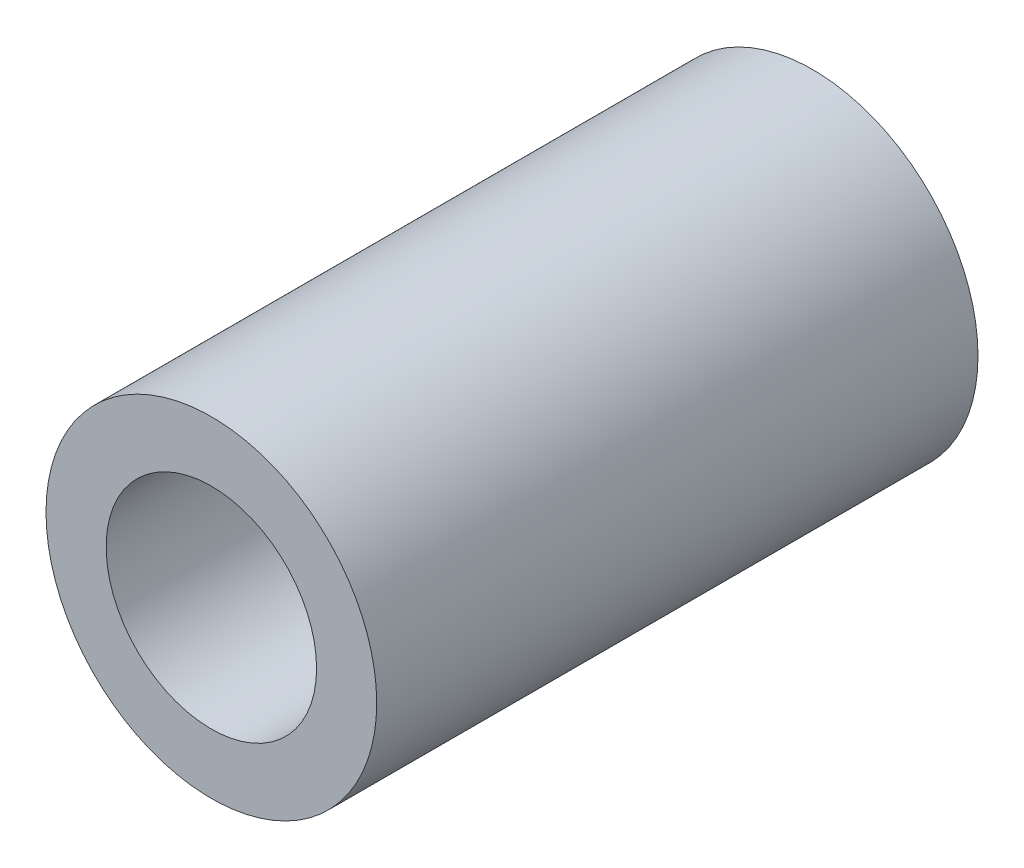
ISO-10303-21;
HEADER;
FILE_DESCRIPTION(('STEP AP214'),'2;1');
FILE_NAME('part.step','',(''),(''),'','','');
FILE_SCHEMA(('AUTOMOTIVE_DESIGN { 1 0 10303 214 1 1 1 1 }'));
ENDSEC;
DATA;
#1=APPLICATION_CONTEXT('core data for automotive mechanical design processes');
#2=APPLICATION_PROTOCOL_DEFINITION('international standard','automotive_design',2000,#1);
#3=PRODUCT_CONTEXT('',#1,'mechanical');
#4=PRODUCT('Part','Part','',(#3));
#5=PRODUCT_RELATED_PRODUCT_CATEGORY('part','',(#4));
#6=PRODUCT_DEFINITION_FORMATION('','',#4);
#7=PRODUCT_DEFINITION_CONTEXT('part definition',#1,'design');
#8=PRODUCT_DEFINITION('design','',#6,#7);
#9=PRODUCT_DEFINITION_SHAPE('','',#8);
#10=(LENGTH_UNIT() NAMED_UNIT(*) SI_UNIT(.MILLI.,.METRE.));
#11=(NAMED_UNIT(*) PLANE_ANGLE_UNIT() SI_UNIT($,.RADIAN.));
#12=(NAMED_UNIT(*) SI_UNIT($,.STERADIAN.) SOLID_ANGLE_UNIT());
#13=UNCERTAINTY_MEASURE_WITH_UNIT(LENGTH_MEASURE(1.E-05),#10,'distance_accuracy_value','');
#14=(GEOMETRIC_REPRESENTATION_CONTEXT(3) GLOBAL_UNCERTAINTY_ASSIGNED_CONTEXT((#13)) GLOBAL_UNIT_ASSIGNED_CONTEXT((#10,
#11,#12)) REPRESENTATION_CONTEXT('',''));
#15=CARTESIAN_POINT('',(0.,0.,0.));
#16=DIRECTION('',(0.,0.,1.));
#17=DIRECTION('',(1.,0.,0.));
#18=AXIS2_PLACEMENT_3D('',#15,#16,#17);
#19=CARTESIAN_POINT('',(-103.02005175451,119.36492707286,10.));
#20=DIRECTION('',(0.,0.,1.));
#21=DIRECTION('',(1.,0.,0.));
#22=AXIS2_PLACEMENT_3D('',#19,#20,#21);
#23=PLANE('',#22);
#24=CARTESIAN_POINT('',(-103.02005175451,119.36492707286,10.));
#25=DIRECTION('',(0.,0.,1.));
#26=DIRECTION('',(1.,0.,0.));
#27=AXIS2_PLACEMENT_3D('',#24,#25,#26);
#28=CIRCLE('',#27,2.75000000000003);
#29=CARTESIAN_POINT('',(-100.27005175451,119.36492707286,10.));
#30=VERTEX_POINT('',#29);
#31=EDGE_CURVE('E12',#30,#30,#28,.T.);
#32=ORIENTED_EDGE('',*,*,#31,.T.);
#33=EDGE_LOOP('',(#32));
#34=FACE_BOUND('',#33,.T.);
#35=CARTESIAN_POINT('',(-103.02005175451,119.36492707286,10.));
#36=DIRECTION('',(0.,0.,1.));
#37=DIRECTION('',(1.,0.,0.));
#38=AXIS2_PLACEMENT_3D('',#35,#36,#37);
#39=CIRCLE('',#38,1.75000000000003);
#40=CARTESIAN_POINT('',(-101.27005175451,119.36492707286,10.));
#41=VERTEX_POINT('',#40);
#42=EDGE_CURVE('E52',#41,#41,#39,.T.);
#43=ORIENTED_EDGE('',*,*,#42,.F.);
#44=EDGE_LOOP('',(#43));
#45=FACE_BOUND('',#44,.T.);
#46=ADVANCED_FACE('F41',(#34,#45),#23,.T.);
#47=CARTESIAN_POINT('',(-103.02005175451,119.36492707286,0.));
#48=DIRECTION('',(0.,0.,1.));
#49=DIRECTION('',(1.,0.,0.));
#50=AXIS2_PLACEMENT_3D('',#47,#48,#49);
#51=PLANE('',#50);
#52=CARTESIAN_POINT('',(-103.02005175451,119.36492707286,0.));
#53=DIRECTION('',(0.,0.,1.));
#54=DIRECTION('',(1.,0.,0.));
#55=AXIS2_PLACEMENT_3D('',#52,#53,#54);
#56=CIRCLE('',#55,2.75000000000003);
#57=CARTESIAN_POINT('',(-100.27005175451,119.36492707286,0.));
#58=VERTEX_POINT('',#57);
#59=EDGE_CURVE('E45',#58,#58,#56,.T.);
#60=ORIENTED_EDGE('',*,*,#59,.F.);
#61=EDGE_LOOP('',(#60));
#62=FACE_BOUND('',#61,.T.);
#63=CARTESIAN_POINT('',(-103.02005175451,119.36492707286,0.));
#64=DIRECTION('',(0.,0.,1.));
#65=DIRECTION('',(1.,0.,0.));
#66=AXIS2_PLACEMENT_3D('',#63,#64,#65);
#67=CIRCLE('',#66,1.75000000000003);
#68=CARTESIAN_POINT('',(-101.27005175451,119.36492707286,0.));
#69=VERTEX_POINT('',#68);
#70=EDGE_CURVE('E54',#69,#69,#67,.T.);
#71=ORIENTED_EDGE('',*,*,#70,.T.);
#72=EDGE_LOOP('',(#71));
#73=FACE_BOUND('',#72,.T.);
#74=ADVANCED_FACE('F64',(#62,#73),#51,.F.);
#75=CARTESIAN_POINT('',(-103.02005175451,119.36492707286,10.));
#76=DIRECTION('',(0.,0.,-1.));
#77=DIRECTION('',(-1.,0.,0.));
#78=AXIS2_PLACEMENT_3D('',#75,#76,#77);
#79=CYLINDRICAL_SURFACE('',#78,2.75000000000003);
#80=ORIENTED_EDGE('',*,*,#31,.F.);
#81=EDGE_LOOP('',(#80));
#82=FACE_BOUND('',#81,.T.);
#83=ORIENTED_EDGE('',*,*,#59,.T.);
#84=EDGE_LOOP('',(#83));
#85=FACE_BOUND('',#84,.T.);
#86=ADVANCED_FACE('F43',(#82,#85),#79,.T.);
#87=CARTESIAN_POINT('',(-103.02005175451,119.36492707286,10.));
#88=DIRECTION('',(0.,0.,-1.));
#89=DIRECTION('',(-1.,0.,0.));
#90=AXIS2_PLACEMENT_3D('',#87,#88,#89);
#91=CYLINDRICAL_SURFACE('',#90,1.75000000000003);
#92=ORIENTED_EDGE('',*,*,#42,.T.);
#93=EDGE_LOOP('',(#92));
#94=FACE_BOUND('',#93,.T.);
#95=ORIENTED_EDGE('',*,*,#70,.F.);
#96=EDGE_LOOP('',(#95));
#97=FACE_BOUND('',#96,.T.);
#98=ADVANCED_FACE('F60',(#94,#97),#91,.F.);
#99=CLOSED_SHELL('',(#46,#74,#86,#98));
#100=MANIFOLD_SOLID_BREP('B2',#99);
#101=ADVANCED_BREP_SHAPE_REPRESENTATION('',(#18,#100),#14);
#102=SHAPE_DEFINITION_REPRESENTATION(#9,#101);
ENDSEC;
END-ISO-10303-21;
